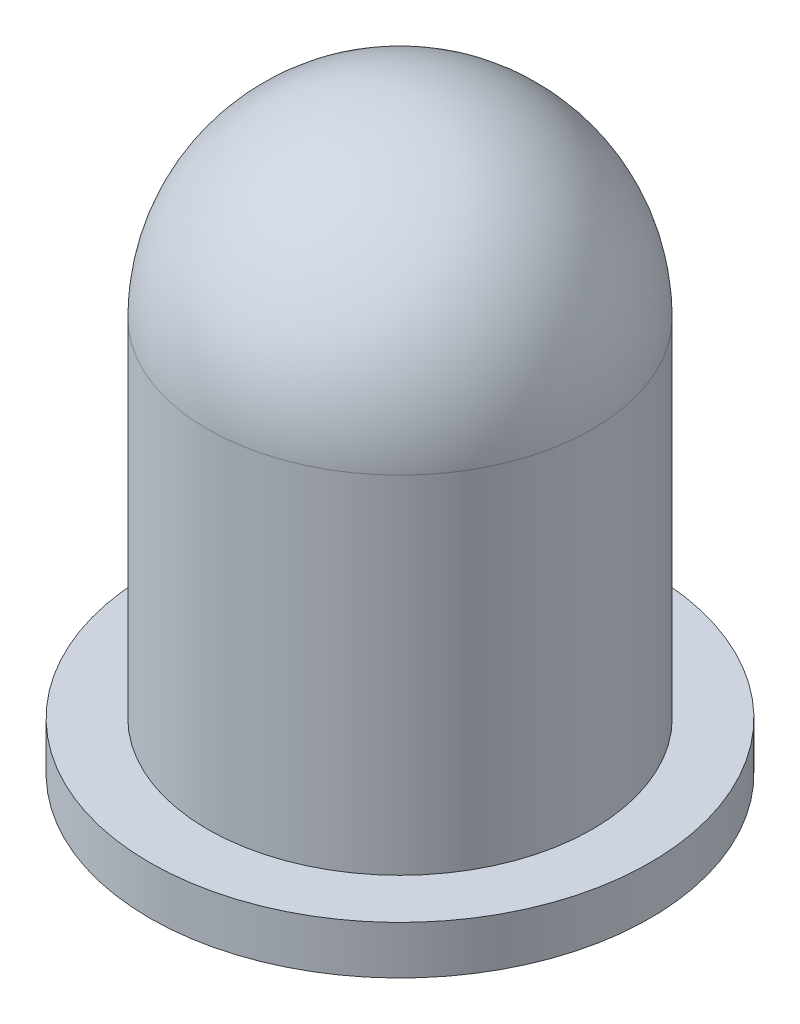
ISO-10303-21;
HEADER;
FILE_DESCRIPTION(('STEP AP214'),'2;1');
FILE_NAME('part.step','',(''),(''),'','','');
FILE_SCHEMA(('AUTOMOTIVE_DESIGN { 1 0 10303 214 1 1 1 1 }'));
ENDSEC;
DATA;
#1=APPLICATION_CONTEXT('core data for automotive mechanical design processes');
#2=APPLICATION_PROTOCOL_DEFINITION('international standard','automotive_design',2000,#1);
#3=PRODUCT_CONTEXT('',#1,'mechanical');
#4=PRODUCT('Part','Part','',(#3));
#5=PRODUCT_RELATED_PRODUCT_CATEGORY('part','',(#4));
#6=PRODUCT_DEFINITION_FORMATION('','',#4);
#7=PRODUCT_DEFINITION_CONTEXT('part definition',#1,'design');
#8=PRODUCT_DEFINITION('design','',#6,#7);
#9=PRODUCT_DEFINITION_SHAPE('','',#8);
#10=(LENGTH_UNIT() NAMED_UNIT(*) SI_UNIT(.MILLI.,.METRE.));
#11=(NAMED_UNIT(*) PLANE_ANGLE_UNIT() SI_UNIT($,.RADIAN.));
#12=(NAMED_UNIT(*) SI_UNIT($,.STERADIAN.) SOLID_ANGLE_UNIT());
#13=UNCERTAINTY_MEASURE_WITH_UNIT(LENGTH_MEASURE(1.E-05),#10,'distance_accuracy_value','');
#14=(GEOMETRIC_REPRESENTATION_CONTEXT(3) GLOBAL_UNCERTAINTY_ASSIGNED_CONTEXT((#13)) GLOBAL_UNIT_ASSIGNED_CONTEXT((#10,
#11,#12)) REPRESENTATION_CONTEXT('',''));
#15=CARTESIAN_POINT('',(0.,0.,0.));
#16=DIRECTION('',(0.,0.,1.));
#17=DIRECTION('',(1.,0.,0.));
#18=AXIS2_PLACEMENT_3D('',#15,#16,#17);
#19=CARTESIAN_POINT('',(178.926639519455,20.4846743295019,0.));
#20=DIRECTION('',(0.,1.,0.));
#21=DIRECTION('',(1.,0.,0.));
#22=AXIS2_PLACEMENT_3D('',#19,#20,#21);
#23=SPHERICAL_SURFACE('',#22,2.00000000000002);
#24=CARTESIAN_POINT('',(178.926639519455,20.4846743295019,0.));
#25=DIRECTION('',(0.,1.,0.));
#26=DIRECTION('',(0.,0.,1.));
#27=AXIS2_PLACEMENT_3D('',#24,#25,#26);
#28=CIRCLE('',#27,2.00000000000003);
#29=CARTESIAN_POINT('',(178.926639519455,20.4846743295019,2.00000000000003));
#30=VERTEX_POINT('',#29);
#31=EDGE_CURVE('E10',#30,#30,#28,.T.);
#32=ORIENTED_EDGE('',*,*,#31,.T.);
#33=EDGE_LOOP('',(#32));
#34=FACE_BOUND('',#33,.T.);
#35=ADVANCED_FACE('F33',(#34),#23,.T.);
#36=CARTESIAN_POINT('',(178.926639519455,29.0977538125804,0.));
#37=DIRECTION('',(0.,1.,0.));
#38=DIRECTION('',(0.,0.,1.));
#39=AXIS2_PLACEMENT_3D('',#36,#37,#38);
#40=CYLINDRICAL_SURFACE('',#39,2.00000000000002);
#41=ORIENTED_EDGE('',*,*,#31,.F.);
#42=EDGE_LOOP('',(#41));
#43=FACE_BOUND('',#42,.T.);
#44=CARTESIAN_POINT('',(178.926639519455,16.8846743295019,0.));
#45=DIRECTION('',(0.,1.,0.));
#46=DIRECTION('',(0.,0.,1.));
#47=AXIS2_PLACEMENT_3D('',#44,#45,#46);
#48=CIRCLE('',#47,2.);
#49=CARTESIAN_POINT('',(178.926639519455,16.8846743295019,2.));
#50=VERTEX_POINT('',#49);
#51=EDGE_CURVE('E39',#50,#50,#48,.T.);
#52=ORIENTED_EDGE('',*,*,#51,.T.);
#53=EDGE_LOOP('',(#52));
#54=FACE_BOUND('',#53,.T.);
#55=ADVANCED_FACE('F65',(#43,#54),#40,.T.);
#56=CARTESIAN_POINT('',(357.853279038911,16.8846743295019,-1.24943804580818E-12));
#57=DIRECTION('',(0.,1.,0.));
#58=DIRECTION('',(0.,0.,1.));
#59=AXIS2_PLACEMENT_3D('',#56,#57,#58);
#60=PLANE('',#59);
#61=CARTESIAN_POINT('',(178.926639519455,16.8846743295019,0.));
#62=DIRECTION('',(0.,1.,0.));
#63=DIRECTION('',(0.,0.,1.));
#64=AXIS2_PLACEMENT_3D('',#61,#62,#63);
#65=CIRCLE('',#64,2.60000000000002);
#66=CARTESIAN_POINT('',(178.926639519455,16.8846743295019,2.60000000000002));
#67=VERTEX_POINT('',#66);
#68=EDGE_CURVE('E43',#67,#67,#65,.T.);
#69=ORIENTED_EDGE('',*,*,#68,.T.);
#70=EDGE_LOOP('',(#69));
#71=FACE_BOUND('',#70,.T.);
#72=ORIENTED_EDGE('',*,*,#51,.F.);
#73=EDGE_LOOP('',(#72));
#74=FACE_BOUND('',#73,.T.);
#75=ADVANCED_FACE('F62',(#71,#74),#60,.T.);
#76=CARTESIAN_POINT('',(178.926639519455,29.0977538125804,0.));
#77=DIRECTION('',(0.,1.,0.));
#78=DIRECTION('',(0.,0.,1.));
#79=AXIS2_PLACEMENT_3D('',#76,#77,#78);
#80=CYLINDRICAL_SURFACE('',#79,2.60000000000002);
#81=CARTESIAN_POINT('',(178.926639519455,16.3846743295019,0.));
#82=DIRECTION('',(0.,1.,0.));
#83=DIRECTION('',(0.,0.,1.));
#84=AXIS2_PLACEMENT_3D('',#81,#82,#83);
#85=CIRCLE('',#84,2.60000000000002);
#86=CARTESIAN_POINT('',(178.926639519455,16.3846743295019,2.60000000000002));
#87=VERTEX_POINT('',#86);
#88=EDGE_CURVE('E47',#87,#87,#85,.T.);
#89=ORIENTED_EDGE('',*,*,#88,.T.);
#90=EDGE_LOOP('',(#89));
#91=FACE_BOUND('',#90,.T.);
#92=ORIENTED_EDGE('',*,*,#68,.F.);
#93=EDGE_LOOP('',(#92));
#94=FACE_BOUND('',#93,.T.);
#95=ADVANCED_FACE('F53',(#91,#94),#80,.T.);
#96=CARTESIAN_POINT('',(357.853279038911,16.3846743295019,-1.24943804580818E-12));
#97=DIRECTION('',(0.,-1.,0.));
#98=DIRECTION('',(0.,0.,-1.));
#99=AXIS2_PLACEMENT_3D('',#96,#97,#98);
#100=PLANE('',#99);
#101=ORIENTED_EDGE('',*,*,#88,.F.);
#102=EDGE_LOOP('',(#101));
#103=FACE_BOUND('',#102,.T.);
#104=ADVANCED_FACE('F56',(#103),#100,.T.);
#105=CLOSED_SHELL('',(#35,#55,#75,#95,#104));
#106=MANIFOLD_SOLID_BREP('B2',#105);
#107=ADVANCED_BREP_SHAPE_REPRESENTATION('',(#18,#106),#14);
#108=SHAPE_DEFINITION_REPRESENTATION(#9,#107);
ENDSEC;
END-ISO-10303-21;
